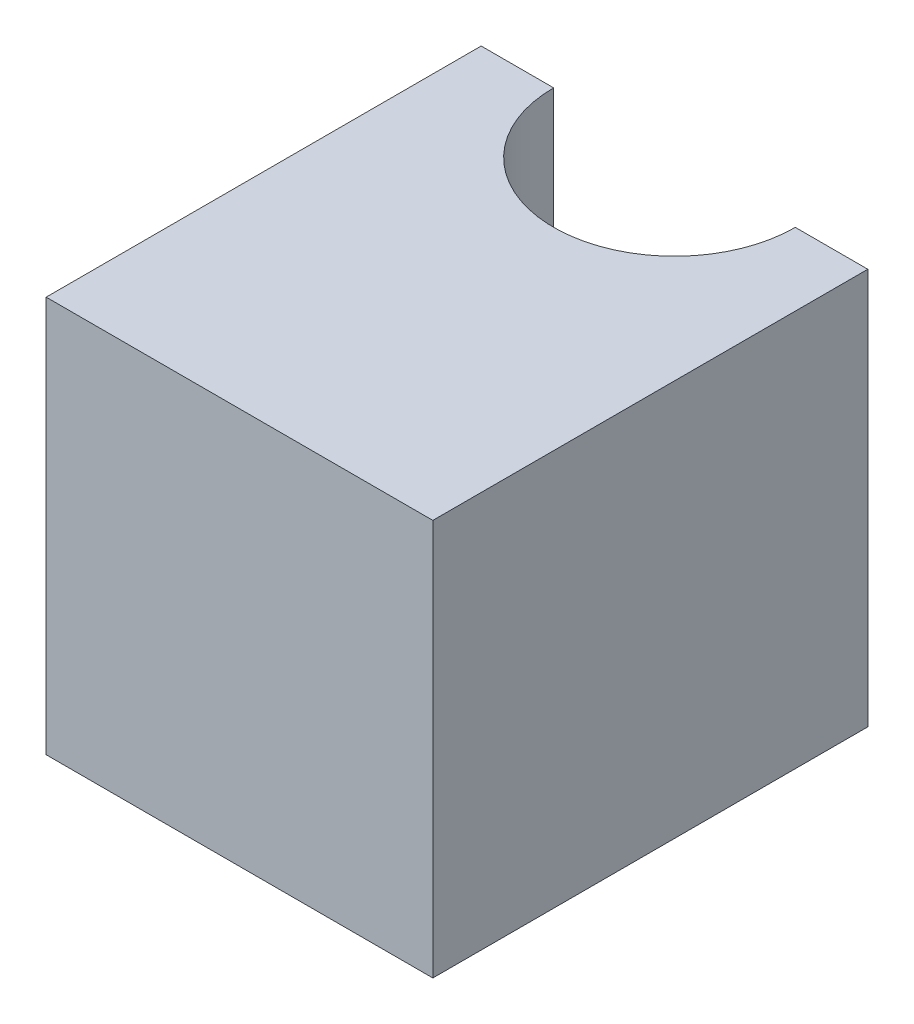
ISO-10303-21;
HEADER;
FILE_DESCRIPTION(('STEP AP214'),'2;1');
FILE_NAME('part.step','',(''),(''),'','','');
FILE_SCHEMA(('AUTOMOTIVE_DESIGN { 1 0 10303 214 1 1 1 1 }'));
ENDSEC;
DATA;
#1=APPLICATION_CONTEXT('core data for automotive mechanical design processes');
#2=APPLICATION_PROTOCOL_DEFINITION('international standard','automotive_design',2000,#1);
#3=PRODUCT_CONTEXT('',#1,'mechanical');
#4=PRODUCT('Part','Part','',(#3));
#5=PRODUCT_RELATED_PRODUCT_CATEGORY('part','',(#4));
#6=PRODUCT_DEFINITION_FORMATION('','',#4);
#7=PRODUCT_DEFINITION_CONTEXT('part definition',#1,'design');
#8=PRODUCT_DEFINITION('design','',#6,#7);
#9=PRODUCT_DEFINITION_SHAPE('','',#8);
#10=(LENGTH_UNIT() NAMED_UNIT(*) SI_UNIT(.MILLI.,.METRE.));
#11=(NAMED_UNIT(*) PLANE_ANGLE_UNIT() SI_UNIT($,.RADIAN.));
#12=(NAMED_UNIT(*) SI_UNIT($,.STERADIAN.) SOLID_ANGLE_UNIT());
#13=UNCERTAINTY_MEASURE_WITH_UNIT(LENGTH_MEASURE(1.E-05),#10,'distance_accuracy_value','');
#14=(GEOMETRIC_REPRESENTATION_CONTEXT(3) GLOBAL_UNCERTAINTY_ASSIGNED_CONTEXT((#13)) GLOBAL_UNIT_ASSIGNED_CONTEXT((#10,
#11,#12)) REPRESENTATION_CONTEXT('',''));
#15=CARTESIAN_POINT('',(0.,0.,0.));
#16=DIRECTION('',(0.,0.,1.));
#17=DIRECTION('',(1.,0.,0.));
#18=AXIS2_PLACEMENT_3D('',#15,#16,#17);
#19=CARTESIAN_POINT('',(-5.9,0.,-6.1));
#20=DIRECTION('',(0.,1.,0.));
#21=DIRECTION('',(0.,0.,1.));
#22=AXIS2_PLACEMENT_3D('',#19,#20,#21);
#23=CYLINDRICAL_SURFACE('',#22,0.25);
#24=DIRECTION('',(0.,1.,0.));
#25=VECTOR('',#24,1.);
#26=CARTESIAN_POINT('',(-6.15,0.,-6.1));
#27=LINE('',#26,#25);
#28=CARTESIAN_POINT('',(-6.15,0.82,-6.1));
#29=VERTEX_POINT('',#28);
#30=CARTESIAN_POINT('',(-6.15,0.,-6.1));
#31=VERTEX_POINT('',#30);
#32=EDGE_CURVE('E119',#29,#31,#27,.F.);
#33=ORIENTED_EDGE('',*,*,#32,.F.);
#34=CARTESIAN_POINT('',(-5.9,0.82,-6.1));
#35=DIRECTION('',(0.,1.,0.));
#36=DIRECTION('',(0.,0.,1.));
#37=AXIS2_PLACEMENT_3D('',#34,#35,#36);
#38=CIRCLE('',#37,0.25);
#39=CARTESIAN_POINT('',(-5.65,0.82,-6.1));
#40=VERTEX_POINT('',#39);
#41=EDGE_CURVE('E80',#40,#29,#38,.F.);
#42=ORIENTED_EDGE('',*,*,#41,.F.);
#43=DIRECTION('',(0.,1.,0.));
#44=VECTOR('',#43,1.);
#45=CARTESIAN_POINT('',(-5.65,0.,-6.1));
#46=LINE('',#45,#44);
#47=CARTESIAN_POINT('',(-5.65,0.,-6.1));
#48=VERTEX_POINT('',#47);
#49=EDGE_CURVE('E78',#48,#40,#46,.T.);
#50=ORIENTED_EDGE('',*,*,#49,.F.);
#51=CARTESIAN_POINT('',(-5.9,0.,-6.1));
#52=DIRECTION('',(0.,1.,0.));
#53=DIRECTION('',(0.,0.,1.));
#54=AXIS2_PLACEMENT_3D('',#51,#52,#53);
#55=CIRCLE('',#54,0.25);
#56=EDGE_CURVE('E20',#48,#31,#55,.F.);
#57=ORIENTED_EDGE('',*,*,#56,.T.);
#58=EDGE_LOOP('',(#33,#42,#50,#57));
#59=FACE_BOUND('',#58,.T.);
#60=ADVANCED_FACE('F17',(#59),#23,.F.);
#61=CARTESIAN_POINT('',(-6.15,0.,-6.1));
#62=DIRECTION('',(0.,0.,-1.));
#63=DIRECTION('',(-1.,0.,0.));
#64=AXIS2_PLACEMENT_3D('',#61,#62,#63);
#65=PLANE('',#64);
#66=DIRECTION('',(1.,0.,0.));
#67=VECTOR('',#66,1.);
#68=CARTESIAN_POINT('',(-5.9,0.82,-6.1));
#69=LINE('',#68,#67);
#70=CARTESIAN_POINT('',(-6.3,0.82,-6.1));
#71=VERTEX_POINT('',#70);
#72=EDGE_CURVE('E104',#29,#71,#69,.F.);
#73=ORIENTED_EDGE('',*,*,#72,.F.);
#74=ORIENTED_EDGE('',*,*,#32,.T.);
#75=DIRECTION('',(1.,0.,0.));
#76=VECTOR('',#75,1.);
#77=CARTESIAN_POINT('',(-5.9,0.,-6.1));
#78=LINE('',#77,#76);
#79=CARTESIAN_POINT('',(-6.3,0.,-6.1));
#80=VERTEX_POINT('',#79);
#81=EDGE_CURVE('E73',#31,#80,#78,.F.);
#82=ORIENTED_EDGE('',*,*,#81,.T.);
#83=DIRECTION('',(0.,1.,0.));
#84=VECTOR('',#83,1.);
#85=CARTESIAN_POINT('',(-6.3,0.,-6.1));
#86=LINE('',#85,#84);
#87=EDGE_CURVE('E76',#71,#80,#86,.F.);
#88=ORIENTED_EDGE('',*,*,#87,.F.);
#89=EDGE_LOOP('',(#73,#74,#82,#88));
#90=FACE_BOUND('',#89,.T.);
#91=ADVANCED_FACE('F196',(#90),#65,.T.);
#92=CARTESIAN_POINT('',(-6.3,0.,-6.1));
#93=DIRECTION('',(-1.,0.,0.));
#94=DIRECTION('',(0.,0.,1.));
#95=AXIS2_PLACEMENT_3D('',#92,#93,#94);
#96=PLANE('',#95);
#97=DIRECTION('',(0.,0.,1.));
#98=VECTOR('',#97,1.);
#99=CARTESIAN_POINT('',(-6.3,0.82,-5.65));
#100=LINE('',#99,#98);
#101=CARTESIAN_POINT('',(-6.3,0.82,-5.2));
#102=VERTEX_POINT('',#101);
#103=EDGE_CURVE('E83',#71,#102,#100,.T.);
#104=ORIENTED_EDGE('',*,*,#103,.F.);
#105=ORIENTED_EDGE('',*,*,#87,.T.);
#106=DIRECTION('',(0.,0.,1.));
#107=VECTOR('',#106,1.);
#108=CARTESIAN_POINT('',(-6.3,0.,-5.65));
#109=LINE('',#108,#107);
#110=CARTESIAN_POINT('',(-6.3,0.,-5.2));
#111=VERTEX_POINT('',#110);
#112=EDGE_CURVE('E89',#80,#111,#109,.T.);
#113=ORIENTED_EDGE('',*,*,#112,.T.);
#114=DIRECTION('',(0.,1.,0.));
#115=VECTOR('',#114,1.);
#116=CARTESIAN_POINT('',(-6.3,0.,-5.2));
#117=LINE('',#116,#115);
#118=EDGE_CURVE('E100',#102,#111,#117,.F.);
#119=ORIENTED_EDGE('',*,*,#118,.F.);
#120=EDGE_LOOP('',(#104,#105,#113,#119));
#121=FACE_BOUND('',#120,.T.);
#122=ADVANCED_FACE('F187',(#121),#96,.T.);
#123=CARTESIAN_POINT('',(-5.9,0.,-5.65));
#124=DIRECTION('',(0.,1.,0.));
#125=DIRECTION('',(0.,0.,1.));
#126=AXIS2_PLACEMENT_3D('',#123,#124,#125);
#127=PLANE('',#126);
#128=ORIENTED_EDGE('',*,*,#81,.F.);
#129=ORIENTED_EDGE('',*,*,#56,.F.);
#130=DIRECTION('',(-1.,0.,0.));
#131=VECTOR('',#130,1.);
#132=CARTESIAN_POINT('',(-5.5,0.,-6.1));
#133=LINE('',#132,#131);
#134=CARTESIAN_POINT('',(-5.5,0.,-6.1));
#135=VERTEX_POINT('',#134);
#136=EDGE_CURVE('E70',#135,#48,#133,.T.);
#137=ORIENTED_EDGE('',*,*,#136,.F.);
#138=DIRECTION('',(0.,0.,-1.));
#139=VECTOR('',#138,1.);
#140=CARTESIAN_POINT('',(-5.5,0.,-5.2));
#141=LINE('',#140,#139);
#142=CARTESIAN_POINT('',(-5.5,0.,-5.2));
#143=VERTEX_POINT('',#142);
#144=EDGE_CURVE('E98',#143,#135,#141,.T.);
#145=ORIENTED_EDGE('',*,*,#144,.F.);
#146=DIRECTION('',(1.,0.,0.));
#147=VECTOR('',#146,1.);
#148=CARTESIAN_POINT('',(-6.3,0.,-5.2));
#149=LINE('',#148,#147);
#150=EDGE_CURVE('E107',#111,#143,#149,.T.);
#151=ORIENTED_EDGE('',*,*,#150,.F.);
#152=ORIENTED_EDGE('',*,*,#112,.F.);
#153=EDGE_LOOP('',(#128,#129,#137,#145,#151,#152));
#154=FACE_BOUND('',#153,.T.);
#155=ADVANCED_FACE('F68',(#154),#127,.F.);
#156=CARTESIAN_POINT('',(-5.5,0.,-6.1));
#157=DIRECTION('',(0.,0.,-1.));
#158=DIRECTION('',(-1.,0.,0.));
#159=AXIS2_PLACEMENT_3D('',#156,#157,#158);
#160=PLANE('',#159);
#161=DIRECTION('',(1.,0.,0.));
#162=VECTOR('',#161,1.);
#163=CARTESIAN_POINT('',(-5.9,0.82,-6.1));
#164=LINE('',#163,#162);
#165=CARTESIAN_POINT('',(-5.5,0.82,-6.1));
#166=VERTEX_POINT('',#165);
#167=EDGE_CURVE('E105',#166,#40,#164,.F.);
#168=ORIENTED_EDGE('',*,*,#167,.F.);
#169=DIRECTION('',(0.,1.,0.));
#170=VECTOR('',#169,1.);
#171=CARTESIAN_POINT('',(-5.5,0.,-6.1));
#172=LINE('',#171,#170);
#173=EDGE_CURVE('E87',#135,#166,#172,.T.);
#174=ORIENTED_EDGE('',*,*,#173,.F.);
#175=ORIENTED_EDGE('',*,*,#136,.T.);
#176=ORIENTED_EDGE('',*,*,#49,.T.);
#177=EDGE_LOOP('',(#168,#174,#175,#176));
#178=FACE_BOUND('',#177,.T.);
#179=ADVANCED_FACE('F85',(#178),#160,.T.);
#180=CARTESIAN_POINT('',(-5.9,0.82,-5.65));
#181=DIRECTION('',(0.,1.,0.));
#182=DIRECTION('',(0.,0.,1.));
#183=AXIS2_PLACEMENT_3D('',#180,#181,#182);
#184=PLANE('',#183);
#185=ORIENTED_EDGE('',*,*,#41,.T.);
#186=ORIENTED_EDGE('',*,*,#72,.T.);
#187=ORIENTED_EDGE('',*,*,#103,.T.);
#188=DIRECTION('',(1.,0.,0.));
#189=VECTOR('',#188,1.);
#190=CARTESIAN_POINT('',(-6.3,0.82,-5.2));
#191=LINE('',#190,#189);
#192=CARTESIAN_POINT('',(-5.5,0.82,-5.2));
#193=VERTEX_POINT('',#192);
#194=EDGE_CURVE('E35',#193,#102,#191,.F.);
#195=ORIENTED_EDGE('',*,*,#194,.F.);
#196=DIRECTION('',(0.,0.,-1.));
#197=VECTOR('',#196,1.);
#198=CARTESIAN_POINT('',(-5.5,0.82,-5.2));
#199=LINE('',#198,#197);
#200=EDGE_CURVE('E26',#166,#193,#199,.F.);
#201=ORIENTED_EDGE('',*,*,#200,.F.);
#202=ORIENTED_EDGE('',*,*,#167,.T.);
#203=EDGE_LOOP('',(#185,#186,#187,#195,#201,#202));
#204=FACE_BOUND('',#203,.T.);
#205=ADVANCED_FACE('F145',(#204),#184,.T.);
#206=CARTESIAN_POINT('',(-6.3,0.,-5.2));
#207=DIRECTION('',(0.,0.,1.));
#208=DIRECTION('',(1.,0.,0.));
#209=AXIS2_PLACEMENT_3D('',#206,#207,#208);
#210=PLANE('',#209);
#211=ORIENTED_EDGE('',*,*,#194,.T.);
#212=ORIENTED_EDGE('',*,*,#118,.T.);
#213=ORIENTED_EDGE('',*,*,#150,.T.);
#214=DIRECTION('',(0.,1.,0.));
#215=VECTOR('',#214,1.);
#216=CARTESIAN_POINT('',(-5.5,0.,-5.2));
#217=LINE('',#216,#215);
#218=EDGE_CURVE('E11',#193,#143,#217,.F.);
#219=ORIENTED_EDGE('',*,*,#218,.F.);
#220=EDGE_LOOP('',(#211,#212,#213,#219));
#221=FACE_BOUND('',#220,.T.);
#222=ADVANCED_FACE('F141',(#221),#210,.T.);
#223=CARTESIAN_POINT('',(-5.5,0.,-5.2));
#224=DIRECTION('',(1.,0.,0.));
#225=DIRECTION('',(0.,0.,-1.));
#226=AXIS2_PLACEMENT_3D('',#223,#224,#225);
#227=PLANE('',#226);
#228=ORIENTED_EDGE('',*,*,#200,.T.);
#229=ORIENTED_EDGE('',*,*,#218,.T.);
#230=ORIENTED_EDGE('',*,*,#144,.T.);
#231=ORIENTED_EDGE('',*,*,#173,.T.);
#232=EDGE_LOOP('',(#228,#229,#230,#231));
#233=FACE_BOUND('',#232,.T.);
#234=ADVANCED_FACE('F144',(#233),#227,.T.);
#235=CLOSED_SHELL('',(#60,#91,#122,#155,#179,#205,#222,#234));
#236=MANIFOLD_SOLID_BREP('B1',#235);
#237=ADVANCED_BREP_SHAPE_REPRESENTATION('',(#18,#236),#14);
#238=SHAPE_DEFINITION_REPRESENTATION(#9,#237);
ENDSEC;
END-ISO-10303-21;
